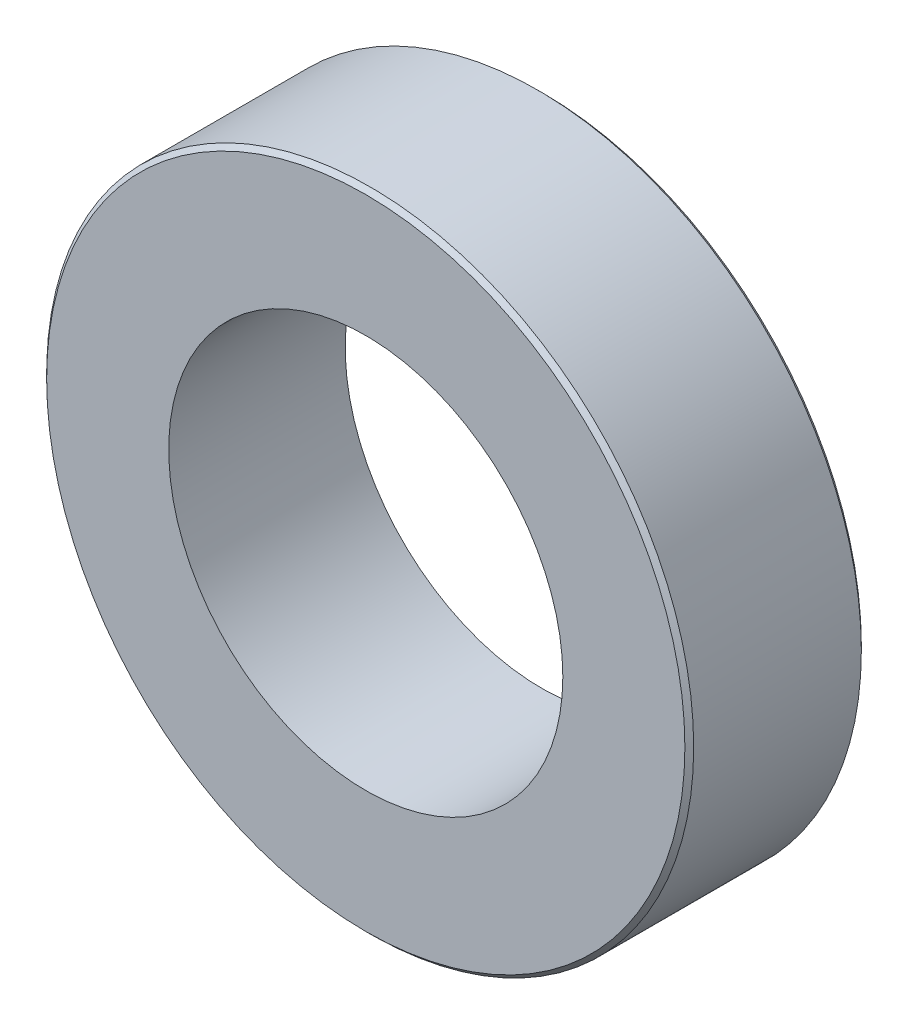
ISO-10303-21;
HEADER;
FILE_DESCRIPTION(('STEP AP214'),'2;1');
FILE_NAME('part.step','',(''),(''),'','','');
FILE_SCHEMA(('AUTOMOTIVE_DESIGN { 1 0 10303 214 1 1 1 1 }'));
ENDSEC;
DATA;
#1=APPLICATION_CONTEXT('core data for automotive mechanical design processes');
#2=APPLICATION_PROTOCOL_DEFINITION('international standard','automotive_design',2000,#1);
#3=PRODUCT_CONTEXT('',#1,'mechanical');
#4=PRODUCT('Part','Part','',(#3));
#5=PRODUCT_RELATED_PRODUCT_CATEGORY('part','',(#4));
#6=PRODUCT_DEFINITION_FORMATION('','',#4);
#7=PRODUCT_DEFINITION_CONTEXT('part definition',#1,'design');
#8=PRODUCT_DEFINITION('design','',#6,#7);
#9=PRODUCT_DEFINITION_SHAPE('','',#8);
#10=(LENGTH_UNIT() NAMED_UNIT(*) SI_UNIT(.MILLI.,.METRE.));
#11=(NAMED_UNIT(*) PLANE_ANGLE_UNIT() SI_UNIT($,.RADIAN.));
#12=(NAMED_UNIT(*) SI_UNIT($,.STERADIAN.) SOLID_ANGLE_UNIT());
#13=UNCERTAINTY_MEASURE_WITH_UNIT(LENGTH_MEASURE(1.E-05),#10,'distance_accuracy_value','');
#14=(GEOMETRIC_REPRESENTATION_CONTEXT(3) GLOBAL_UNCERTAINTY_ASSIGNED_CONTEXT((#13)) GLOBAL_UNIT_ASSIGNED_CONTEXT((#10,
#11,#12)) REPRESENTATION_CONTEXT('',''));
#15=CARTESIAN_POINT('',(0.,0.,0.));
#16=DIRECTION('',(0.,0.,1.));
#17=DIRECTION('',(1.,0.,0.));
#18=AXIS2_PLACEMENT_3D('',#15,#16,#17);
#19=CARTESIAN_POINT('',(0.,0.,3.));
#20=DIRECTION('',(0.,0.,1.));
#21=DIRECTION('',(1.,0.,0.));
#22=AXIS2_PLACEMENT_3D('',#19,#20,#21);
#23=PLANE('',#22);
#24=CARTESIAN_POINT('',(0.,0.,3.));
#25=DIRECTION('',(0.,0.,1.));
#26=DIRECTION('',(1.,0.,0.));
#27=AXIS2_PLACEMENT_3D('',#24,#25,#26);
#28=CIRCLE('',#27,10.85);
#29=CARTESIAN_POINT('',(10.85,0.,3.));
#30=VERTEX_POINT('',#29);
#31=EDGE_CURVE('E10',#30,#30,#28,.T.);
#32=ORIENTED_EDGE('',*,*,#31,.T.);
#33=EDGE_LOOP('',(#32));
#34=FACE_BOUND('',#33,.T.);
#35=CARTESIAN_POINT('',(0.,0.,3.));
#36=DIRECTION('',(0.,0.,1.));
#37=DIRECTION('',(1.,0.,0.));
#38=AXIS2_PLACEMENT_3D('',#35,#36,#37);
#39=CIRCLE('',#38,6.7);
#40=CARTESIAN_POINT('',(6.7,0.,3.));
#41=VERTEX_POINT('',#40);
#42=EDGE_CURVE('E51',#41,#41,#39,.T.);
#43=ORIENTED_EDGE('',*,*,#42,.F.);
#44=EDGE_LOOP('',(#43));
#45=FACE_BOUND('',#44,.T.);
#46=ADVANCED_FACE('F31',(#34,#45),#23,.T.);
#47=CARTESIAN_POINT('',(0.,0.,-3.));
#48=DIRECTION('',(0.,0.,1.));
#49=DIRECTION('',(1.,0.,0.));
#50=AXIS2_PLACEMENT_3D('',#47,#48,#49);
#51=PLANE('',#50);
#52=CARTESIAN_POINT('',(0.,0.,-3.));
#53=DIRECTION('',(0.,0.,1.));
#54=DIRECTION('',(1.,0.,0.));
#55=AXIS2_PLACEMENT_3D('',#52,#53,#54);
#56=CIRCLE('',#55,10.85);
#57=CARTESIAN_POINT('',(10.85,0.,-3.));
#58=VERTEX_POINT('',#57);
#59=EDGE_CURVE('E38',#58,#58,#56,.F.);
#60=ORIENTED_EDGE('',*,*,#59,.T.);
#61=EDGE_LOOP('',(#60));
#62=FACE_BOUND('',#61,.T.);
#63=CARTESIAN_POINT('',(0.,0.,-3.));
#64=DIRECTION('',(0.,0.,1.));
#65=DIRECTION('',(1.,0.,0.));
#66=AXIS2_PLACEMENT_3D('',#63,#64,#65);
#67=CIRCLE('',#66,6.7);
#68=CARTESIAN_POINT('',(6.7,0.,-3.));
#69=VERTEX_POINT('',#68);
#70=EDGE_CURVE('E52',#69,#69,#67,.T.);
#71=ORIENTED_EDGE('',*,*,#70,.T.);
#72=EDGE_LOOP('',(#71));
#73=FACE_BOUND('',#72,.T.);
#74=ADVANCED_FACE('F62',(#62,#73),#51,.F.);
#75=CARTESIAN_POINT('',(0.,0.,3.));
#76=DIRECTION('',(0.,0.,-1.));
#77=DIRECTION('',(-1.,0.,0.));
#78=AXIS2_PLACEMENT_3D('',#75,#76,#77);
#79=CYLINDRICAL_SURFACE('',#78,11.);
#80=CARTESIAN_POINT('',(0.,0.,-2.85));
#81=DIRECTION('',(0.,0.,1.));
#82=DIRECTION('',(1.,0.,0.));
#83=AXIS2_PLACEMENT_3D('',#80,#81,#82);
#84=CIRCLE('',#83,11.);
#85=CARTESIAN_POINT('',(11.,0.,-2.85));
#86=VERTEX_POINT('',#85);
#87=EDGE_CURVE('E42',#86,#86,#84,.T.);
#88=ORIENTED_EDGE('',*,*,#87,.T.);
#89=EDGE_LOOP('',(#88));
#90=FACE_BOUND('',#89,.T.);
#91=CARTESIAN_POINT('',(0.,0.,2.85000000000001));
#92=DIRECTION('',(0.,0.,1.));
#93=DIRECTION('',(1.,0.,0.));
#94=AXIS2_PLACEMENT_3D('',#91,#92,#93);
#95=CIRCLE('',#94,11.);
#96=CARTESIAN_POINT('',(11.,0.,2.85000000000001));
#97=VERTEX_POINT('',#96);
#98=EDGE_CURVE('E46',#97,#97,#95,.F.);
#99=ORIENTED_EDGE('',*,*,#98,.T.);
#100=EDGE_LOOP('',(#99));
#101=FACE_BOUND('',#100,.T.);
#102=ADVANCED_FACE('F67',(#90,#101),#79,.T.);
#103=CARTESIAN_POINT('',(0.,0.,3.));
#104=DIRECTION('',(0.,0.,-1.));
#105=DIRECTION('',(-1.,0.,0.));
#106=AXIS2_PLACEMENT_3D('',#103,#104,#105);
#107=CYLINDRICAL_SURFACE('',#106,6.7);
#108=ORIENTED_EDGE('',*,*,#42,.T.);
#109=EDGE_LOOP('',(#108));
#110=FACE_BOUND('',#109,.T.);
#111=ORIENTED_EDGE('',*,*,#70,.F.);
#112=EDGE_LOOP('',(#111));
#113=FACE_BOUND('',#112,.T.);
#114=ADVANCED_FACE('F58',(#110,#113),#107,.F.);
#115=CARTESIAN_POINT('',(0.,0.,-2.85));
#116=DIRECTION('',(0.,0.,1.));
#117=DIRECTION('',(1.,0.,0.));
#118=AXIS2_PLACEMENT_3D('',#115,#116,#117);
#119=CONICAL_SURFACE('',#118,11.,0.785398163397448);
#120=ORIENTED_EDGE('',*,*,#59,.F.);
#121=EDGE_LOOP('',(#120));
#122=FACE_BOUND('',#121,.T.);
#123=ORIENTED_EDGE('',*,*,#87,.F.);
#124=EDGE_LOOP('',(#123));
#125=FACE_BOUND('',#124,.T.);
#126=ADVANCED_FACE('F73',(#122,#125),#119,.T.);
#127=CARTESIAN_POINT('',(0.,0.,3.));
#128=DIRECTION('',(0.,0.,-1.));
#129=DIRECTION('',(-1.,0.,0.));
#130=AXIS2_PLACEMENT_3D('',#127,#128,#129);
#131=CONICAL_SURFACE('',#130,10.85,0.785398163397471);
#132=ORIENTED_EDGE('',*,*,#98,.F.);
#133=EDGE_LOOP('',(#132));
#134=FACE_BOUND('',#133,.T.);
#135=ORIENTED_EDGE('',*,*,#31,.F.);
#136=EDGE_LOOP('',(#135));
#137=FACE_BOUND('',#136,.T.);
#138=ADVANCED_FACE('F33',(#134,#137),#131,.T.);
#139=CLOSED_SHELL('',(#46,#74,#102,#114,#126,#138));
#140=MANIFOLD_SOLID_BREP('B2',#139);
#141=ADVANCED_BREP_SHAPE_REPRESENTATION('',(#18,#140),#14);
#142=SHAPE_DEFINITION_REPRESENTATION(#9,#141);
ENDSEC;
END-ISO-10303-21;
